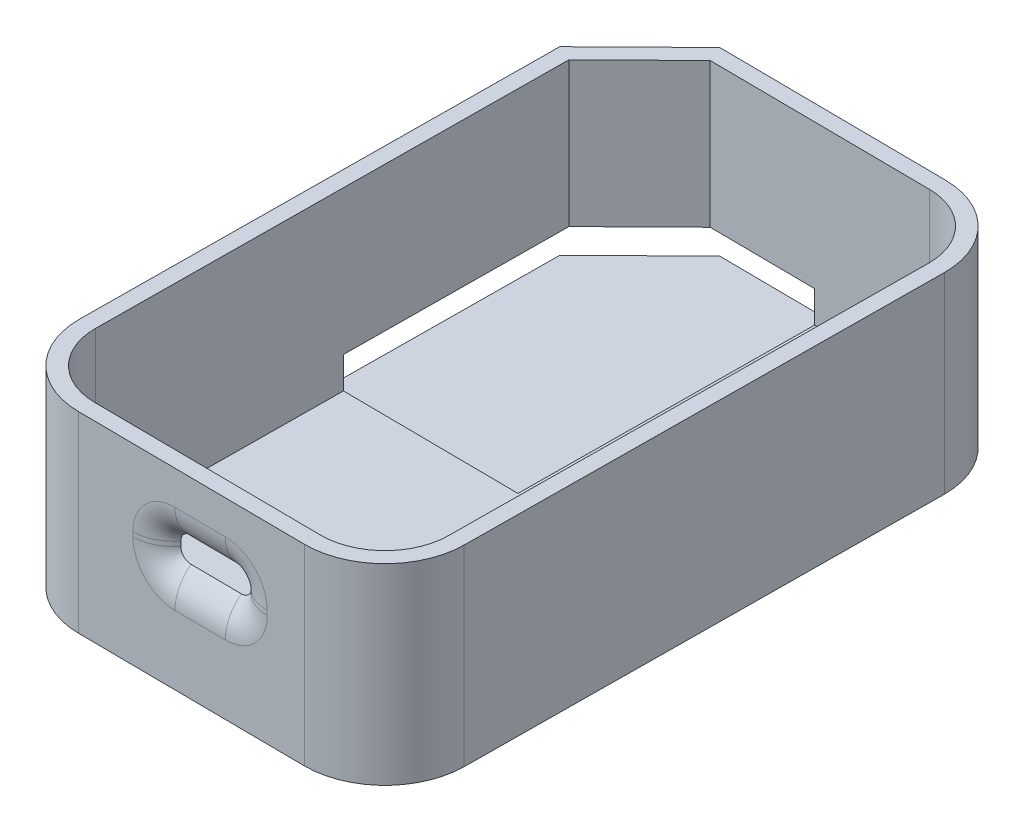
ISO-10303-21;
HEADER;
FILE_DESCRIPTION(('STEP AP214'),'2;1');
FILE_NAME('part.step','',(''),(''),'','','');
FILE_SCHEMA(('AUTOMOTIVE_DESIGN { 1 0 10303 214 1 1 1 1 }'));
ENDSEC;
DATA;
#1=APPLICATION_CONTEXT('core data for automotive mechanical design processes');
#2=APPLICATION_PROTOCOL_DEFINITION('international standard','automotive_design',2000,#1);
#3=PRODUCT_CONTEXT('',#1,'mechanical');
#4=PRODUCT('Part','Part','',(#3));
#5=PRODUCT_RELATED_PRODUCT_CATEGORY('part','',(#4));
#6=PRODUCT_DEFINITION_FORMATION('','',#4);
#7=PRODUCT_DEFINITION_CONTEXT('part definition',#1,'design');
#8=PRODUCT_DEFINITION('design','',#6,#7);
#9=PRODUCT_DEFINITION_SHAPE('','',#8);
#10=(LENGTH_UNIT() NAMED_UNIT(*) SI_UNIT(.MILLI.,.METRE.));
#11=(NAMED_UNIT(*) PLANE_ANGLE_UNIT() SI_UNIT($,.RADIAN.));
#12=(NAMED_UNIT(*) SI_UNIT($,.STERADIAN.) SOLID_ANGLE_UNIT());
#13=UNCERTAINTY_MEASURE_WITH_UNIT(LENGTH_MEASURE(1.E-05),#10,'distance_accuracy_value','');
#14=(GEOMETRIC_REPRESENTATION_CONTEXT(3) GLOBAL_UNCERTAINTY_ASSIGNED_CONTEXT((#13)) GLOBAL_UNIT_ASSIGNED_CONTEXT((#10,
#11,#12)) REPRESENTATION_CONTEXT('',''));
#15=CARTESIAN_POINT('',(0.,0.,0.));
#16=DIRECTION('',(0.,0.,1.));
#17=DIRECTION('',(1.,0.,0.));
#18=AXIS2_PLACEMENT_3D('',#15,#16,#17);
#19=CARTESIAN_POINT('',(-25.6124297825195,22.,-67.102484938882));
#20=DIRECTION('',(0.700909264300127,0.,0.713250449153911));
#21=DIRECTION('',(0.713250449153911,0.,-0.700909264300127));
#22=AXIS2_PLACEMENT_3D('',#19,#20,#21);
#23=PLANE('',#22);
#24=DIRECTION('',(0.,-1.,0.));
#25=VECTOR('',#24,1.);
#26=CARTESIAN_POINT('',(-35.6993143681448,22.,-57.1901310632165));
#27=LINE('',#26,#25);
#28=CARTESIAN_POINT('',(-35.6993143681448,-0.586956373766086,-57.1901310632165));
#29=VERTEX_POINT('',#28);
#30=CARTESIAN_POINT('',(-35.6993143681448,-2.,-57.1901310632165));
#31=VERTEX_POINT('',#30);
#32=EDGE_CURVE('E477',#29,#31,#27,.T.);
#33=ORIENTED_EDGE('',*,*,#32,.F.);
#34=DIRECTION('',(0.713250449153911,0.,-0.700909264300127));
#35=VECTOR('',#34,1.);
#36=CARTESIAN_POINT('',(-25.6124297825195,-0.586956373766087,-67.102484938882));
#37=LINE('',#36,#35);
#38=CARTESIAN_POINT('',(-25.6124297825195,-0.586956373766087,-67.102484938882));
#39=VERTEX_POINT('',#38);
#40=EDGE_CURVE('E337',#29,#39,#37,.T.);
#41=ORIENTED_EDGE('',*,*,#40,.T.);
#42=DIRECTION('',(0.,-1.,0.));
#43=VECTOR('',#42,1.);
#44=CARTESIAN_POINT('',(-25.6124297825195,22.,-67.102484938882));
#45=LINE('',#44,#43);
#46=CARTESIAN_POINT('',(-25.6124297825195,-2.,-67.102484938882));
#47=VERTEX_POINT('',#46);
#48=EDGE_CURVE('E473',#39,#47,#45,.T.);
#49=ORIENTED_EDGE('',*,*,#48,.T.);
#50=DIRECTION('',(0.713250449153911,0.,-0.700909264300127));
#51=VECTOR('',#50,1.);
#52=CARTESIAN_POINT('',(-46.1288480767684,-2.,-46.9410568321713));
#53=LINE('',#52,#51);
#54=EDGE_CURVE('E380',#31,#47,#53,.T.);
#55=ORIENTED_EDGE('',*,*,#54,.F.);
#56=EDGE_LOOP('',(#33,#41,#49,#55));
#57=FACE_BOUND('',#56,.T.);
#58=ADVANCED_FACE('F89',(#57),#23,.F.);
#59=CARTESIAN_POINT('',(2.79921966982612,22.,-56.8541594465581));
#60=DIRECTION('',(0.,-1.,0.));
#61=DIRECTION('',(0.,0.,-1.));
#62=AXIS2_PLACEMENT_3D('',#59,#60,#61);
#63=CYLINDRICAL_SURFACE('',#62,10.);
#64=DIRECTION('',(0.,-1.,0.));
#65=VECTOR('',#64,1.);
#66=CARTESIAN_POINT('',(12.7988389004678,22.,-56.7668940915745));
#67=LINE('',#66,#65);
#68=CARTESIAN_POINT('',(12.7988389004678,22.,-56.7668940915745));
#69=VERTEX_POINT('',#68);
#70=CARTESIAN_POINT('',(12.7988389004678,-2.,-56.7668940915745));
#71=VERTEX_POINT('',#70);
#72=EDGE_CURVE('E467',#69,#71,#67,.T.);
#73=ORIENTED_EDGE('',*,*,#72,.T.);
#74=CARTESIAN_POINT('',(2.79921966982612,-2.,-56.8541594465581));
#75=DIRECTION('',(0.,-1.,0.));
#76=DIRECTION('',(0.,0.,-1.));
#77=AXIS2_PLACEMENT_3D('',#74,#75,#76);
#78=CIRCLE('',#77,10.);
#79=CARTESIAN_POINT('',(2.88648502480233,-2.,-66.8537786771998));
#80=VERTEX_POINT('',#79);
#81=EDGE_CURVE('E362',#80,#71,#78,.T.);
#82=ORIENTED_EDGE('',*,*,#81,.F.);
#83=DIRECTION('',(0.,-1.,0.));
#84=VECTOR('',#83,1.);
#85=CARTESIAN_POINT('',(2.88648502480233,22.,-66.8537786771998));
#86=LINE('',#85,#84);
#87=CARTESIAN_POINT('',(2.88648502480233,22.,-66.8537786771998));
#88=VERTEX_POINT('',#87);
#89=EDGE_CURVE('E468',#88,#80,#86,.T.);
#90=ORIENTED_EDGE('',*,*,#89,.F.);
#91=CARTESIAN_POINT('',(2.79921966982612,22.,-56.8541594465581));
#92=DIRECTION('',(0.,-1.,0.));
#93=DIRECTION('',(0.,0.,-1.));
#94=AXIS2_PLACEMENT_3D('',#91,#92,#93);
#95=CIRCLE('',#94,10.);
#96=EDGE_CURVE('E426',#88,#69,#95,.T.);
#97=ORIENTED_EDGE('',*,*,#96,.T.);
#98=EDGE_LOOP('',(#73,#82,#90,#97));
#99=FACE_BOUND('',#98,.T.);
#100=ADVANCED_FACE('F556',(#99),#63,.T.);
#101=CARTESIAN_POINT('',(-25.6124297825195,22.,-67.102484938882));
#102=DIRECTION('',(0.00872653549762053,0.,-0.999961923064178));
#103=DIRECTION('',(-0.999961923064178,0.,-0.00872653549762053));
#104=AXIS2_PLACEMENT_3D('',#101,#102,#103);
#105=PLANE('',#104);
#106=DIRECTION('',(-0.999961923064172,0.,-0.00872653549835296));
#107=VECTOR('',#106,1.);
#108=CARTESIAN_POINT('',(-11.6129628596211,-0.586956373766087,-66.980313441905));
#109=LINE('',#108,#107);
#110=CARTESIAN_POINT('',(-11.6129628596211,-0.586956373766087,-66.980313441905));
#111=VERTEX_POINT('',#110);
#112=EDGE_CURVE('E311',#111,#39,#109,.T.);
#113=ORIENTED_EDGE('',*,*,#112,.F.);
#114=DIRECTION('',(0.,-1.,0.));
#115=VECTOR('',#114,1.);
#116=CARTESIAN_POINT('',(-11.6129628596211,3.94324801505611,-66.980313441905));
#117=LINE('',#116,#115);
#118=CARTESIAN_POINT('',(-11.6129628596211,3.94324801505611,-66.980313441905));
#119=VERTEX_POINT('',#118);
#120=EDGE_CURVE('E297',#119,#111,#117,.T.);
#121=ORIENTED_EDGE('',*,*,#120,.F.);
#122=DIRECTION('',(-0.999961923064172,0.,-0.00872653549835296));
#123=VECTOR('',#122,1.);
#124=CARTESIAN_POINT('',(-11.6129628596211,3.94324801505611,-66.980313441905));
#125=LINE('',#124,#123);
#126=CARTESIAN_POINT('',(-25.6124297825195,3.94324801505611,-67.102484938882));
#127=VERTEX_POINT('',#126);
#128=EDGE_CURVE('E305',#119,#127,#125,.T.);
#129=ORIENTED_EDGE('',*,*,#128,.T.);
#130=CARTESIAN_POINT('',(-25.6124297825195,22.,-67.102484938882));
#131=VERTEX_POINT('',#130);
#132=EDGE_CURVE('E471',#131,#127,#45,.T.);
#133=ORIENTED_EDGE('',*,*,#132,.F.);
#134=DIRECTION('',(0.999961923064178,0.,0.00872653549762053));
#135=VECTOR('',#134,1.);
#136=CARTESIAN_POINT('',(-25.6124297825195,22.,-67.102484938882));
#137=LINE('',#136,#135);
#138=EDGE_CURVE('E464',#131,#88,#137,.T.);
#139=ORIENTED_EDGE('',*,*,#138,.T.);
#140=ORIENTED_EDGE('',*,*,#89,.T.);
#141=DIRECTION('',(0.999961923064178,0.,0.00872653549762053));
#142=VECTOR('',#141,1.);
#143=CARTESIAN_POINT('',(0.583599471446085,-2.,-66.8738756549595));
#144=LINE('',#143,#142);
#145=EDGE_CURVE('E347',#47,#80,#144,.T.);
#146=ORIENTED_EDGE('',*,*,#145,.F.);
#147=ORIENTED_EDGE('',*,*,#48,.F.);
#148=EDGE_LOOP('',(#113,#121,#129,#133,#139,#140,#146,#147));
#149=FACE_BOUND('',#148,.T.);
#150=ADVANCED_FACE('F315',(#149),#105,.T.);
#151=ORIENTED_EDGE('',*,*,#132,.T.);
#152=DIRECTION('',(-0.713250449153911,0.,0.700909264300127));
#153=VECTOR('',#152,1.);
#154=CARTESIAN_POINT('',(-25.6124297825195,3.94324801505611,-67.102484938882));
#155=LINE('',#154,#153);
#156=CARTESIAN_POINT('',(-35.6993143681448,3.94324801505611,-57.1901310632165));
#157=VERTEX_POINT('',#156);
#158=EDGE_CURVE('E308',#127,#157,#155,.T.);
#159=ORIENTED_EDGE('',*,*,#158,.T.);
#160=CARTESIAN_POINT('',(-35.6993143681448,22.,-57.1901310632165));
#161=VERTEX_POINT('',#160);
#162=EDGE_CURVE('E474',#161,#157,#27,.T.);
#163=ORIENTED_EDGE('',*,*,#162,.F.);
#164=DIRECTION('',(-0.713250449153911,0.,0.700909264300127));
#165=VECTOR('',#164,1.);
#166=CARTESIAN_POINT('',(-25.6124297825195,22.,-67.102484938882));
#167=LINE('',#166,#165);
#168=EDGE_CURVE('E462',#131,#161,#167,.T.);
#169=ORIENTED_EDGE('',*,*,#168,.F.);
#170=EDGE_LOOP('',(#151,#159,#163,#169));
#171=FACE_BOUND('',#170,.T.);
#172=ADVANCED_FACE('F581',(#171),#23,.F.);
#173=CARTESIAN_POINT('',(-35.6993143681448,22.,-57.1901310632165));
#174=DIRECTION('',(0.999961923064172,0.,0.00872653549835296));
#175=DIRECTION('',(0.00872653549835296,0.,-0.999961923064172));
#176=AXIS2_PLACEMENT_3D('',#173,#174,#175);
#177=PLANE('',#176);
#178=DIRECTION('',(0.,1.,0.));
#179=VECTOR('',#178,1.);
#180=CARTESIAN_POINT('',(-35.9503940231901,3.94324801505612,-28.4192523165744));
#181=LINE('',#180,#179);
#182=CARTESIAN_POINT('',(-35.9503940231901,-0.586956373766083,-28.4192523165744));
#183=VERTEX_POINT('',#182);
#184=CARTESIAN_POINT('',(-35.9503940231901,3.94324801505612,-28.4192523165707));
#185=VERTEX_POINT('',#184);
#186=EDGE_CURVE('E104',#183,#185,#181,.T.);
#187=ORIENTED_EDGE('',*,*,#186,.F.);
#188=DIRECTION('',(0.00872653549835296,0.,-0.999961923064172));
#189=VECTOR('',#188,1.);
#190=CARTESIAN_POINT('',(-35.6993143681448,-0.586956373766087,-57.1901310632165));
#191=LINE('',#190,#189);
#192=EDGE_CURVE('E12',#183,#29,#191,.T.);
#193=ORIENTED_EDGE('',*,*,#192,.T.);
#194=ORIENTED_EDGE('',*,*,#32,.T.);
#195=DIRECTION('',(0.00872653549835296,0.,-0.999961923064172));
#196=VECTOR('',#195,1.);
#197=CARTESIAN_POINT('',(-36.1956484846561,-2.,-0.315874638925613));
#198=LINE('',#197,#196);
#199=CARTESIAN_POINT('',(-36.2185432302965,-2.,2.30760335907133));
#200=VERTEX_POINT('',#199);
#201=EDGE_CURVE('E377',#200,#31,#198,.T.);
#202=ORIENTED_EDGE('',*,*,#201,.F.);
#203=DIRECTION('',(0.,-1.,0.));
#204=VECTOR('',#203,1.);
#205=CARTESIAN_POINT('',(-36.2185432302965,22.,2.30760335907132));
#206=LINE('',#205,#204);
#207=CARTESIAN_POINT('',(-36.2185432302965,22.,2.30760335907132));
#208=VERTEX_POINT('',#207);
#209=EDGE_CURVE('E478',#208,#200,#206,.T.);
#210=ORIENTED_EDGE('',*,*,#209,.F.);
#211=DIRECTION('',(-0.00872653549835296,0.,0.999961923064172));
#212=VECTOR('',#211,1.);
#213=CARTESIAN_POINT('',(-35.6993143681448,22.,-57.1901310632165));
#214=LINE('',#213,#212);
#215=EDGE_CURVE('E460',#161,#208,#214,.T.);
#216=ORIENTED_EDGE('',*,*,#215,.F.);
#217=ORIENTED_EDGE('',*,*,#162,.T.);
#218=DIRECTION('',(0.00872653549835306,0.,-0.999961923064171));
#219=VECTOR('',#218,1.);
#220=CARTESIAN_POINT('',(-35.9503940231901,3.94324801505612,-28.4192523165744));
#221=LINE('',#220,#219);
#222=EDGE_CURVE('E323',#185,#157,#221,.T.);
#223=ORIENTED_EDGE('',*,*,#222,.F.);
#224=EDGE_LOOP('',(#187,#193,#194,#202,#210,#216,#217,#223));
#225=FACE_BOUND('',#224,.T.);
#226=ADVANCED_FACE('F545',(#225),#177,.F.);
#227=CARTESIAN_POINT('',(-26.2189239996548,22.,2.39486871405484));
#228=DIRECTION('',(0.,-1.,0.));
#229=DIRECTION('',(0.,0.,-1.));
#230=AXIS2_PLACEMENT_3D('',#227,#228,#229);
#231=CYLINDRICAL_SURFACE('',#230,9.99999999999999);
#232=ORIENTED_EDGE('',*,*,#209,.T.);
#233=CARTESIAN_POINT('',(-26.2189239996548,-2.,2.39486871405484));
#234=DIRECTION('',(0.,-1.,0.));
#235=DIRECTION('',(0.,0.,-1.));
#236=AXIS2_PLACEMENT_3D('',#233,#234,#235);
#237=CIRCLE('',#236,9.99999999999999);
#238=CARTESIAN_POINT('',(-26.3061893546383,-2.,12.3944879446966));
#239=VERTEX_POINT('',#238);
#240=EDGE_CURVE('E374',#239,#200,#237,.T.);
#241=ORIENTED_EDGE('',*,*,#240,.F.);
#242=DIRECTION('',(0.,-1.,0.));
#243=VECTOR('',#242,1.);
#244=CARTESIAN_POINT('',(-26.3061893546383,22.,12.3944879446966));
#245=LINE('',#244,#243);
#246=CARTESIAN_POINT('',(-26.3061893546383,22.,12.3944879446966));
#247=VERTEX_POINT('',#246);
#248=EDGE_CURVE('E480',#247,#239,#245,.T.);
#249=ORIENTED_EDGE('',*,*,#248,.F.);
#250=CARTESIAN_POINT('',(-26.2189239996548,22.,2.39486871405484));
#251=DIRECTION('',(0.,-1.,0.));
#252=DIRECTION('',(0.,0.,-1.));
#253=AXIS2_PLACEMENT_3D('',#250,#251,#252);
#254=CIRCLE('',#253,9.99999999999999);
#255=EDGE_CURVE('E457',#247,#208,#254,.T.);
#256=ORIENTED_EDGE('',*,*,#255,.T.);
#257=EDGE_LOOP('',(#232,#241,#249,#256));
#258=FACE_BOUND('',#257,.T.);
#259=ADVANCED_FACE('F575',(#258),#231,.T.);
#260=CARTESIAN_POINT('',(-26.3061893546383,22.,12.3944879446966));
#261=DIRECTION('',(0.00872653549834512,0.,-0.999961923064172));
#262=DIRECTION('',(-0.999961923064172,0.,-0.00872653549834512));
#263=AXIS2_PLACEMENT_3D('',#260,#261,#262);
#264=PLANE('',#263);
#265=DIRECTION('',(0.999961923064172,0.,0.00872653549834512));
#266=VECTOR('',#265,1.);
#267=CARTESIAN_POINT('',(-26.3061893546377,6.60548389285194,12.3944879446966));
#268=LINE('',#267,#266);
#269=CARTESIAN_POINT('',(-7.77229509541314,6.60548389285248,12.5562307895442));
#270=VERTEX_POINT('',#269);
#271=CARTESIAN_POINT('',(-14.121253337332,6.60548389285236,12.5008242703581));
#272=VERTEX_POINT('',#271);
#273=EDGE_CURVE('E498',#270,#272,#268,.F.);
#274=ORIENTED_EDGE('',*,*,#273,.T.);
#275=CARTESIAN_POINT('',(-14.1212533373322,11.9008838928524,12.5008242703581));
#276=DIRECTION('',(0.00872653549834512,0.,-0.999961923064172));
#277=DIRECTION('',(-0.999961923064172,0.,-0.00872653549834512));
#278=AXIS2_PLACEMENT_3D('',#275,#276,#277);
#279=CIRCLE('',#278,5.2954);
#280=CARTESIAN_POINT('',(-19.4164517047262,11.9008838928524,12.4546137742802));
#281=VERTEX_POINT('',#280);
#282=EDGE_CURVE('E500',#272,#281,#279,.T.);
#283=ORIENTED_EDGE('',*,*,#282,.T.);
#284=DIRECTION('',(0.,-1.,0.));
#285=VECTOR('',#284,1.);
#286=CARTESIAN_POINT('',(-19.4164517047262,22.,12.4546137742802));
#287=LINE('',#286,#285);
#288=CARTESIAN_POINT('',(-19.4164517047262,12.4700838928524,12.4546137742802));
#289=VERTEX_POINT('',#288);
#290=EDGE_CURVE('E470',#281,#289,#287,.F.);
#291=ORIENTED_EDGE('',*,*,#290,.T.);
#292=CARTESIAN_POINT('',(-14.1212533373322,12.4700838928524,12.5008242703581));
#293=DIRECTION('',(0.00872653549834512,0.,-0.999961923064172));
#294=DIRECTION('',(-0.999961923064172,0.,-0.00872653549834512));
#295=AXIS2_PLACEMENT_3D('',#292,#293,#294);
#296=CIRCLE('',#295,5.29539999999999);
#297=CARTESIAN_POINT('',(-14.1212533373323,17.7654838928524,12.5008242703581));
#298=VERTEX_POINT('',#297);
#299=EDGE_CURVE('E488',#289,#298,#296,.T.);
#300=ORIENTED_EDGE('',*,*,#299,.T.);
#301=DIRECTION('',(-0.999961923064172,0.,-0.00872653549834512));
#302=VECTOR('',#301,1.);
#303=CARTESIAN_POINT('',(-26.3061893546382,17.7654838928523,12.3944879446966));
#304=LINE('',#303,#302);
#305=CARTESIAN_POINT('',(-7.7722950954132,17.7654838928525,12.5562307895442));
#306=VERTEX_POINT('',#305);
#307=EDGE_CURVE('E490',#298,#306,#304,.F.);
#308=ORIENTED_EDGE('',*,*,#307,.T.);
#309=CARTESIAN_POINT('',(-7.77229509541314,12.4700838928525,12.5562307895442));
#310=DIRECTION('',(0.00872653549834512,0.,-0.999961923064172));
#311=DIRECTION('',(-0.999961923064172,0.,-0.00872653549834512));
#312=AXIS2_PLACEMENT_3D('',#309,#310,#311);
#313=CIRCLE('',#312,5.2954);
#314=CARTESIAN_POINT('',(-2.47709672801913,12.4700838928525,12.6024412856221));
#315=VERTEX_POINT('',#314);
#316=EDGE_CURVE('E492',#306,#315,#313,.T.);
#317=ORIENTED_EDGE('',*,*,#316,.T.);
#318=DIRECTION('',(0.,1.,0.));
#319=VECTOR('',#318,1.);
#320=CARTESIAN_POINT('',(-2.47709672801904,21.9999999999998,12.6024412856221));
#321=LINE('',#320,#319);
#322=CARTESIAN_POINT('',(-2.47709672801913,11.9008838928524,12.6024412856221));
#323=VERTEX_POINT('',#322);
#324=EDGE_CURVE('E494',#315,#323,#321,.F.);
#325=ORIENTED_EDGE('',*,*,#324,.T.);
#326=CARTESIAN_POINT('',(-7.77229509541314,11.9008838928525,12.5562307895442));
#327=DIRECTION('',(0.00872653549834512,0.,-0.999961923064172));
#328=DIRECTION('',(-0.999961923064172,0.,-0.00872653549834512));
#329=AXIS2_PLACEMENT_3D('',#326,#327,#328);
#330=CIRCLE('',#329,5.29539999999999);
#331=EDGE_CURVE('E496',#323,#270,#330,.T.);
#332=ORIENTED_EDGE('',*,*,#331,.T.);
#333=EDGE_LOOP('',(#274,#283,#291,#300,#308,#317,#325,#332));
#334=FACE_BOUND('',#333,.T.);
#335=ORIENTED_EDGE('',*,*,#248,.T.);
#336=DIRECTION('',(-0.999961923064172,0.,-0.00872653549834512));
#337=VECTOR('',#336,1.);
#338=CARTESIAN_POINT('',(-0.110160100623857,-2.,12.6230972286384));
#339=LINE('',#338,#337);
#340=CARTESIAN_POINT('',(2.19272545269066,-2.,12.6431942063994));
#341=VERTEX_POINT('',#340);
#342=EDGE_CURVE('E371',#341,#239,#339,.T.);
#343=ORIENTED_EDGE('',*,*,#342,.F.);
#344=DIRECTION('',(0.,-1.,0.));
#345=VECTOR('',#344,1.);
#346=CARTESIAN_POINT('',(2.19272545269065,22.,12.6431942063994));
#347=LINE('',#346,#345);
#348=CARTESIAN_POINT('',(2.19272545269065,22.,12.6431942063994));
#349=VERTEX_POINT('',#348);
#350=EDGE_CURVE('E482',#349,#341,#347,.T.);
#351=ORIENTED_EDGE('',*,*,#350,.F.);
#352=DIRECTION('',(0.999961923064172,0.,0.00872653549834512));
#353=VECTOR('',#352,1.);
#354=CARTESIAN_POINT('',(-26.3061893546383,22.,12.3944879446966));
#355=LINE('',#354,#353);
#356=EDGE_CURVE('E455',#247,#349,#355,.T.);
#357=ORIENTED_EDGE('',*,*,#356,.F.);
#358=EDGE_LOOP('',(#335,#343,#351,#357));
#359=FACE_BOUND('',#358,.T.);
#360=ADVANCED_FACE('F572',(#334,#359),#264,.F.);
#361=CARTESIAN_POINT('',(2.2799908076741,22.,2.64357497575768));
#362=DIRECTION('',(0.,-1.,0.));
#363=DIRECTION('',(0.,0.,-1.));
#364=AXIS2_PLACEMENT_3D('',#361,#362,#363);
#365=CYLINDRICAL_SURFACE('',#364,10.);
#366=ORIENTED_EDGE('',*,*,#350,.T.);
#367=CARTESIAN_POINT('',(2.2799908076741,-2.,2.64357497575768));
#368=DIRECTION('',(0.,-1.,0.));
#369=DIRECTION('',(0.,0.,-1.));
#370=AXIS2_PLACEMENT_3D('',#367,#368,#369);
#371=CIRCLE('',#370,10.);
#372=CARTESIAN_POINT('',(12.2796100383158,-2.,2.73084033074121));
#373=VERTEX_POINT('',#372);
#374=EDGE_CURVE('E368',#373,#341,#371,.T.);
#375=ORIENTED_EDGE('',*,*,#374,.F.);
#376=DIRECTION('',(0.,-1.,0.));
#377=VECTOR('',#376,1.);
#378=CARTESIAN_POINT('',(12.2796100383158,22.,2.73084033074121));
#379=LINE('',#378,#377);
#380=CARTESIAN_POINT('',(12.2796100383158,22.,2.73084033074121));
#381=VERTEX_POINT('',#380);
#382=EDGE_CURVE('E484',#381,#373,#379,.T.);
#383=ORIENTED_EDGE('',*,*,#382,.F.);
#384=CARTESIAN_POINT('',(2.2799908076741,22.,2.64357497575768));
#385=DIRECTION('',(0.,-1.,0.));
#386=DIRECTION('',(0.,0.,-1.));
#387=AXIS2_PLACEMENT_3D('',#384,#385,#386);
#388=CIRCLE('',#387,10.);
#389=EDGE_CURVE('E452',#381,#349,#388,.T.);
#390=ORIENTED_EDGE('',*,*,#389,.T.);
#391=EDGE_LOOP('',(#366,#375,#383,#390));
#392=FACE_BOUND('',#391,.T.);
#393=ADVANCED_FACE('F564',(#392),#365,.T.);
#394=CARTESIAN_POINT('',(12.7988389004678,22.,-56.7668940915745));
#395=DIRECTION('',(0.999961923064172,0.,0.00872653549835387));
#396=DIRECTION('',(0.00872653549835387,0.,-0.999961923064172));
#397=AXIS2_PLACEMENT_3D('',#394,#395,#396);
#398=PLANE('',#397);
#399=ORIENTED_EDGE('',*,*,#382,.T.);
#400=DIRECTION('',(-0.00872653549835387,0.,0.999961923064172));
#401=VECTOR('',#400,1.);
#402=CARTESIAN_POINT('',(12.3025047839562,-2.,0.107362332744517));
#403=LINE('',#402,#401);
#404=EDGE_CURVE('E365',#71,#373,#403,.T.);
#405=ORIENTED_EDGE('',*,*,#404,.F.);
#406=ORIENTED_EDGE('',*,*,#72,.F.);
#407=DIRECTION('',(-0.00872653549835387,0.,0.999961923064171));
#408=VECTOR('',#407,1.);
#409=CARTESIAN_POINT('',(12.7988389004678,22.,-56.7668940915745));
#410=LINE('',#409,#408);
#411=EDGE_CURVE('E449',#69,#381,#410,.T.);
#412=ORIENTED_EDGE('',*,*,#411,.T.);
#413=EDGE_LOOP('',(#399,#405,#406,#412));
#414=FACE_BOUND('',#413,.T.);
#415=ADVANCED_FACE('F560',(#414),#398,.T.);
#416=CARTESIAN_POINT('',(2.79921966982612,22.,-56.8541594465581));
#417=DIRECTION('',(0.,-1.,0.));
#418=DIRECTION('',(0.,0.,-1.));
#419=AXIS2_PLACEMENT_3D('',#416,#417,#418);
#420=PLANE('',#419);
#421=DIRECTION('',(0.999961923064178,0.,0.00872653549762053));
#422=VECTOR('',#421,1.);
#423=CARTESIAN_POINT('',(2.86903195380709,22.,-64.8538548310715));
#424=LINE('',#423,#422);
#425=CARTESIAN_POINT('',(-24.8014872727354,22.,-65.0953317940423));
#426=VERTEX_POINT('',#425);
#427=CARTESIAN_POINT('',(2.8690319538071,22.,-64.8538548310715));
#428=VERTEX_POINT('',#427);
#429=EDGE_CURVE('E403',#426,#428,#424,.T.);
#430=ORIENTED_EDGE('',*,*,#429,.T.);
#431=CARTESIAN_POINT('',(2.79921966982612,22.,-56.8541594465581));
#432=DIRECTION('',(0.,-1.,0.));
#433=DIRECTION('',(-1.,0.,0.));
#434=AXIS2_PLACEMENT_3D('',#431,#432,#433);
#435=CIRCLE('',#434,8.);
#436=CARTESIAN_POINT('',(10.7989150543395,22.,-56.7843471625712));
#437=VERTEX_POINT('',#436);
#438=EDGE_CURVE('E384',#428,#437,#435,.T.);
#439=ORIENTED_EDGE('',*,*,#438,.T.);
#440=DIRECTION('',(-0.00872653549835387,0.,0.999961923064172));
#441=VECTOR('',#440,1.);
#442=CARTESIAN_POINT('',(10.7989150543395,22.,-56.7843471625712));
#443=LINE('',#442,#441);
#444=CARTESIAN_POINT('',(10.2796861921875,22.,2.71338725974452));
#445=VERTEX_POINT('',#444);
#446=EDGE_CURVE('E387',#437,#445,#443,.T.);
#447=ORIENTED_EDGE('',*,*,#446,.T.);
#448=CARTESIAN_POINT('',(2.2799908076741,22.,2.64357497575768));
#449=DIRECTION('',(0.,-1.,0.));
#450=DIRECTION('',(-1.,0.,0.));
#451=AXIS2_PLACEMENT_3D('',#448,#449,#450);
#452=CIRCLE('',#451,8.);
#453=CARTESIAN_POINT('',(2.21017852368734,22.,10.643270360271));
#454=VERTEX_POINT('',#453);
#455=EDGE_CURVE('E391',#445,#454,#452,.T.);
#456=ORIENTED_EDGE('',*,*,#455,.T.);
#457=DIRECTION('',(0.999961923064172,0.,0.00872653549834512));
#458=VECTOR('',#457,1.);
#459=CARTESIAN_POINT('',(2.21017852368785,22.,10.6432703602711));
#460=LINE('',#459,#458);
#461=CARTESIAN_POINT('',(-26.2887362836416,22.,10.3945640985682));
#462=VERTEX_POINT('',#461);
#463=EDGE_CURVE('E394',#462,#454,#460,.T.);
#464=ORIENTED_EDGE('',*,*,#463,.F.);
#465=CARTESIAN_POINT('',(-26.2189239996548,22.,2.39486871405484));
#466=DIRECTION('',(0.,-1.,0.));
#467=DIRECTION('',(-1.,0.,0.));
#468=AXIS2_PLACEMENT_3D('',#465,#466,#467);
#469=CIRCLE('',#468,7.99999999999999);
#470=CARTESIAN_POINT('',(-34.2186193841682,22.,2.32505643006802));
#471=VERTEX_POINT('',#470);
#472=EDGE_CURVE('E396',#462,#471,#469,.T.);
#473=ORIENTED_EDGE('',*,*,#472,.T.);
#474=DIRECTION('',(-0.00872653549835296,0.,0.999961923064172));
#475=VECTOR('',#474,1.);
#476=CARTESIAN_POINT('',(-33.6993905220162,22.,-57.172677992248));
#477=LINE('',#476,#475);
#478=CARTESIAN_POINT('',(-33.7066198207283,22.,-56.3442824114405));
#479=VERTEX_POINT('',#478);
#480=EDGE_CURVE('E399',#479,#471,#477,.T.);
#481=ORIENTED_EDGE('',*,*,#480,.F.);
#482=DIRECTION('',(-0.713250449153911,0.,0.700909264300127));
#483=VECTOR('',#482,1.);
#484=CARTESIAN_POINT('',(-14.8802430122158,22.,-74.8449113755648));
#485=LINE('',#484,#483);
#486=EDGE_CURVE('E401',#426,#479,#485,.T.);
#487=ORIENTED_EDGE('',*,*,#486,.F.);
#488=EDGE_LOOP('',(#430,#439,#447,#456,#464,#473,#481,#487));
#489=FACE_BOUND('',#488,.T.);
#490=ORIENTED_EDGE('',*,*,#96,.F.);
#491=ORIENTED_EDGE('',*,*,#138,.F.);
#492=ORIENTED_EDGE('',*,*,#168,.T.);
#493=ORIENTED_EDGE('',*,*,#215,.T.);
#494=ORIENTED_EDGE('',*,*,#255,.F.);
#495=ORIENTED_EDGE('',*,*,#356,.T.);
#496=ORIENTED_EDGE('',*,*,#389,.F.);
#497=ORIENTED_EDGE('',*,*,#411,.F.);
#498=EDGE_LOOP('',(#490,#491,#492,#493,#494,#495,#496,#497));
#499=FACE_BOUND('',#498,.T.);
#500=ADVANCED_FACE('F566',(#489,#499),#420,.F.);
#501=CARTESIAN_POINT('',(2.79921966982612,22.,-56.8541594465581));
#502=DIRECTION('',(0.,-1.,0.));
#503=DIRECTION('',(0.,0.,-1.));
#504=AXIS2_PLACEMENT_3D('',#501,#502,#503);
#505=CYLINDRICAL_SURFACE('',#504,8.);
#506=CARTESIAN_POINT('',(2.79921966982612,0.,-56.8541594465581));
#507=DIRECTION('',(0.,-1.,0.));
#508=DIRECTION('',(-1.,0.,0.));
#509=AXIS2_PLACEMENT_3D('',#506,#507,#508);
#510=CIRCLE('',#509,8.);
#511=CARTESIAN_POINT('',(2.8690319538071,0.,-64.8538548310715));
#512=VERTEX_POINT('',#511);
#513=CARTESIAN_POINT('',(10.7989150543395,0.,-56.7843471625712));
#514=VERTEX_POINT('',#513);
#515=EDGE_CURVE('E383',#512,#514,#510,.T.);
#516=ORIENTED_EDGE('',*,*,#515,.T.);
#517=DIRECTION('',(0.,-1.,0.));
#518=VECTOR('',#517,1.);
#519=CARTESIAN_POINT('',(10.7989150543395,22.,-56.7843471625712));
#520=LINE('',#519,#518);
#521=EDGE_CURVE('E406',#437,#514,#520,.T.);
#522=ORIENTED_EDGE('',*,*,#521,.F.);
#523=ORIENTED_EDGE('',*,*,#438,.F.);
#524=DIRECTION('',(0.,-1.,0.));
#525=VECTOR('',#524,1.);
#526=CARTESIAN_POINT('',(2.8690319538071,22.,-64.8538548310715));
#527=LINE('',#526,#525);
#528=EDGE_CURVE('E423',#428,#512,#527,.T.);
#529=ORIENTED_EDGE('',*,*,#528,.T.);
#530=EDGE_LOOP('',(#516,#522,#523,#529));
#531=FACE_BOUND('',#530,.T.);
#532=ADVANCED_FACE('F688',(#531),#505,.F.);
#533=CARTESIAN_POINT('',(2.86903195380709,22.,-64.8538548310715));
#534=DIRECTION('',(0.00872653549762053,0.,-0.999961923064178));
#535=DIRECTION('',(-0.999961923064178,0.,-0.00872653549762053));
#536=AXIS2_PLACEMENT_3D('',#533,#534,#535);
#537=PLANE('',#536);
#538=DIRECTION('',(0.,-1.,0.));
#539=VECTOR('',#538,1.);
#540=CARTESIAN_POINT('',(-24.8014872727354,22.,-65.0953317940423));
#541=LINE('',#540,#539);
#542=CARTESIAN_POINT('',(-24.8014872727354,3.94324801505611,-65.0953317940423));
#543=VERTEX_POINT('',#542);
#544=EDGE_CURVE('E427',#426,#543,#541,.T.);
#545=ORIENTED_EDGE('',*,*,#544,.T.);
#546=DIRECTION('',(0.999961923064178,0.,0.00872653549762053));
#547=VECTOR('',#546,1.);
#548=CARTESIAN_POINT('',(2.86903195380709,3.94324801505611,-64.8538548310715));
#549=LINE('',#548,#547);
#550=CARTESIAN_POINT('',(-11.6304159306177,3.94324801505611,-64.9803895957869));
#551=VERTEX_POINT('',#550);
#552=EDGE_CURVE('E334',#543,#551,#549,.T.);
#553=ORIENTED_EDGE('',*,*,#552,.T.);
#554=DIRECTION('',(0.,-1.,0.));
#555=VECTOR('',#554,1.);
#556=CARTESIAN_POINT('',(-11.6304159306177,22.,-64.9803895957869));
#557=LINE('',#556,#555);
#558=CARTESIAN_POINT('',(-11.6304159306177,0.,-64.9803895957869));
#559=VERTEX_POINT('',#558);
#560=EDGE_CURVE('E300',#551,#559,#557,.T.);
#561=ORIENTED_EDGE('',*,*,#560,.T.);
#562=DIRECTION('',(0.999961923064178,0.,0.00872653549762053));
#563=VECTOR('',#562,1.);
#564=CARTESIAN_POINT('',(2.86903195380709,0.,-64.8538548310715));
#565=LINE('',#564,#563);
#566=EDGE_CURVE('E388',#559,#512,#565,.T.);
#567=ORIENTED_EDGE('',*,*,#566,.T.);
#568=ORIENTED_EDGE('',*,*,#528,.F.);
#569=ORIENTED_EDGE('',*,*,#429,.F.);
#570=EDGE_LOOP('',(#545,#553,#561,#567,#568,#569));
#571=FACE_BOUND('',#570,.T.);
#572=ADVANCED_FACE('F682',(#571),#537,.F.);
#573=CARTESIAN_POINT('',(-14.8802430122158,22.,-74.8449113755648));
#574=DIRECTION('',(0.700909264300127,0.,0.713250449153911));
#575=DIRECTION('',(0.713250449153911,0.,-0.700909264300127));
#576=AXIS2_PLACEMENT_3D('',#573,#574,#575);
#577=PLANE('',#576);
#578=DIRECTION('',(-0.713250449153911,0.,0.700909264300127));
#579=VECTOR('',#578,1.);
#580=CARTESIAN_POINT('',(-14.8802430122158,3.94324801505611,-74.8449113755648));
#581=LINE('',#580,#579);
#582=CARTESIAN_POINT('',(-33.7066198207283,3.94324801505611,-56.3442824114405));
#583=VERTEX_POINT('',#582);
#584=EDGE_CURVE('E332',#543,#583,#581,.T.);
#585=ORIENTED_EDGE('',*,*,#584,.F.);
#586=ORIENTED_EDGE('',*,*,#544,.F.);
#587=ORIENTED_EDGE('',*,*,#486,.T.);
#588=DIRECTION('',(0.,-1.,0.));
#589=VECTOR('',#588,1.);
#590=CARTESIAN_POINT('',(-33.7066198207283,22.,-56.3442824114405));
#591=LINE('',#590,#589);
#592=EDGE_CURVE('E430',#479,#583,#591,.T.);
#593=ORIENTED_EDGE('',*,*,#592,.T.);
#594=EDGE_LOOP('',(#585,#586,#587,#593));
#595=FACE_BOUND('',#594,.T.);
#596=ADVANCED_FACE('F687',(#595),#577,.T.);
#597=CARTESIAN_POINT('',(-33.6993905220162,22.,-57.172677992248));
#598=DIRECTION('',(0.999961923064172,0.,0.00872653549835296));
#599=DIRECTION('',(0.00872653549835296,0.,-0.999961923064172));
#600=AXIS2_PLACEMENT_3D('',#597,#598,#599);
#601=PLANE('',#600);
#602=DIRECTION('',(0.,-1.,0.));
#603=VECTOR('',#602,1.);
#604=CARTESIAN_POINT('',(-33.9504701770617,22.,-28.4017992455777));
#605=LINE('',#604,#603);
#606=CARTESIAN_POINT('',(-33.9504701770617,3.94324801505612,-28.4017992455777));
#607=VERTEX_POINT('',#606);
#608=CARTESIAN_POINT('',(-33.9504701770618,0.,-28.4017992455777));
#609=VERTEX_POINT('',#608);
#610=EDGE_CURVE('E330',#607,#609,#605,.T.);
#611=ORIENTED_EDGE('',*,*,#610,.F.);
#612=DIRECTION('',(-0.00872653549835296,0.,0.999961923064172));
#613=VECTOR('',#612,1.);
#614=CARTESIAN_POINT('',(-33.6993905220162,3.94324801505611,-57.172677992248));
#615=LINE('',#614,#613);
#616=EDGE_CURVE('E97',#583,#607,#615,.T.);
#617=ORIENTED_EDGE('',*,*,#616,.F.);
#618=ORIENTED_EDGE('',*,*,#592,.F.);
#619=ORIENTED_EDGE('',*,*,#480,.T.);
#620=DIRECTION('',(0.,-1.,0.));
#621=VECTOR('',#620,1.);
#622=CARTESIAN_POINT('',(-34.2186193841682,22.,2.32505643006802));
#623=LINE('',#622,#621);
#624=CARTESIAN_POINT('',(-34.2186193841682,0.,2.32505643006802));
#625=VERTEX_POINT('',#624);
#626=EDGE_CURVE('E433',#471,#625,#623,.T.);
#627=ORIENTED_EDGE('',*,*,#626,.T.);
#628=DIRECTION('',(-0.00872653549835296,0.,0.999961923064172));
#629=VECTOR('',#628,1.);
#630=CARTESIAN_POINT('',(-33.6993905220162,0.,-57.172677992248));
#631=LINE('',#630,#629);
#632=EDGE_CURVE('E420',#609,#625,#631,.T.);
#633=ORIENTED_EDGE('',*,*,#632,.F.);
#634=EDGE_LOOP('',(#611,#617,#618,#619,#627,#633));
#635=FACE_BOUND('',#634,.T.);
#636=ADVANCED_FACE('F536',(#635),#601,.T.);
#637=CARTESIAN_POINT('',(-26.2189239996548,22.,2.39486871405484));
#638=DIRECTION('',(0.,-1.,0.));
#639=DIRECTION('',(0.,0.,-1.));
#640=AXIS2_PLACEMENT_3D('',#637,#638,#639);
#641=CYLINDRICAL_SURFACE('',#640,7.99999999999999);
#642=CARTESIAN_POINT('',(-26.2189239996548,0.,2.39486871405484));
#643=DIRECTION('',(0.,-1.,0.));
#644=DIRECTION('',(-1.,0.,0.));
#645=AXIS2_PLACEMENT_3D('',#642,#643,#644);
#646=CIRCLE('',#645,7.99999999999999);
#647=CARTESIAN_POINT('',(-26.2887362836416,0.,10.3945640985682));
#648=VERTEX_POINT('',#647);
#649=EDGE_CURVE('E417',#648,#625,#646,.T.);
#650=ORIENTED_EDGE('',*,*,#649,.T.);
#651=ORIENTED_EDGE('',*,*,#626,.F.);
#652=ORIENTED_EDGE('',*,*,#472,.F.);
#653=DIRECTION('',(0.,-1.,0.));
#654=VECTOR('',#653,1.);
#655=CARTESIAN_POINT('',(-26.2887362836416,22.,10.3945640985682));
#656=LINE('',#655,#654);
#657=EDGE_CURVE('E436',#462,#648,#656,.T.);
#658=ORIENTED_EDGE('',*,*,#657,.T.);
#659=EDGE_LOOP('',(#650,#651,#652,#658));
#660=FACE_BOUND('',#659,.T.);
#661=ADVANCED_FACE('F711',(#660),#641,.F.);
#662=CARTESIAN_POINT('',(2.21017852368785,22.,10.6432703602711));
#663=DIRECTION('',(0.00872653549834512,0.,-0.999961923064172));
#664=DIRECTION('',(-0.999961923064172,0.,-0.00872653549834512));
#665=AXIS2_PLACEMENT_3D('',#662,#663,#664);
#666=PLANE('',#665);
#667=CARTESIAN_POINT('',(-7.75484202441645,11.9008838928525,10.5563069434158));
#668=DIRECTION('',(0.00872653549834512,0.,-0.999961923064172));
#669=DIRECTION('',(-0.999961923064172,0.,-0.00872653549834512));
#670=AXIS2_PLACEMENT_3D('',#667,#668,#669);
#671=CIRCLE('',#670,1.29539999999999);
#672=CARTESIAN_POINT('',(-7.75484202441645,10.6054838928526,10.5563069434158));
#673=VERTEX_POINT('',#672);
#674=CARTESIAN_POINT('',(-6.45949134927912,11.9008838928525,10.5676112975004));
#675=VERTEX_POINT('',#674);
#676=EDGE_CURVE('E341',#673,#675,#671,.F.);
#677=ORIENTED_EDGE('',*,*,#676,.T.);
#678=DIRECTION('',(0.,1.,0.));
#679=VECTOR('',#678,1.);
#680=CARTESIAN_POINT('',(-6.45949134927912,11.9008838928525,10.5676112975004));
#681=LINE('',#680,#679);
#682=CARTESIAN_POINT('',(-6.45949134927912,12.4700838928525,10.5676112975004));
#683=VERTEX_POINT('',#682);
#684=EDGE_CURVE('E343',#675,#683,#681,.T.);
#685=ORIENTED_EDGE('',*,*,#684,.T.);
#686=CARTESIAN_POINT('',(-7.75484202441645,12.4700838928525,10.5563069434158));
#687=DIRECTION('',(0.00872653549834512,0.,-0.999961923064172));
#688=DIRECTION('',(-0.999961923064172,0.,-0.00872653549834512));
#689=AXIS2_PLACEMENT_3D('',#686,#687,#688);
#690=CIRCLE('',#689,1.2954);
#691=CARTESIAN_POINT('',(-7.75484202441648,13.7654838928525,10.5563069434158));
#692=VERTEX_POINT('',#691);
#693=EDGE_CURVE('E357',#683,#692,#690,.F.);
#694=ORIENTED_EDGE('',*,*,#693,.T.);
#695=DIRECTION('',(-0.999961923064172,0.,-0.00872653549834512));
#696=VECTOR('',#695,1.);
#697=CARTESIAN_POINT('',(-7.75484202441648,13.7654838928525,10.5563069434158));
#698=LINE('',#697,#696);
#699=CARTESIAN_POINT('',(-14.1038002663355,13.7654838928524,10.5009004242298));
#700=VERTEX_POINT('',#699);
#701=EDGE_CURVE('E355',#692,#700,#698,.T.);
#702=ORIENTED_EDGE('',*,*,#701,.T.);
#703=CARTESIAN_POINT('',(-14.1038002663355,12.4700838928524,10.5009004242298));
#704=DIRECTION('',(0.00872653549834512,0.,-0.999961923064172));
#705=DIRECTION('',(-0.999961923064172,0.,-0.00872653549834512));
#706=AXIS2_PLACEMENT_3D('',#703,#704,#705);
#707=CIRCLE('',#706,1.2954);
#708=CARTESIAN_POINT('',(-15.3991509414728,12.4700838928524,10.4895960701452));
#709=VERTEX_POINT('',#708);
#710=EDGE_CURVE('E353',#700,#709,#707,.F.);
#711=ORIENTED_EDGE('',*,*,#710,.T.);
#712=DIRECTION('',(0.,-1.,0.));
#713=VECTOR('',#712,1.);
#714=CARTESIAN_POINT('',(-15.3991509414728,12.4700838928524,10.4895960701452));
#715=LINE('',#714,#713);
#716=CARTESIAN_POINT('',(-15.3991509414728,11.9008838928524,10.4895960701452));
#717=VERTEX_POINT('',#716);
#718=EDGE_CURVE('E351',#709,#717,#715,.T.);
#719=ORIENTED_EDGE('',*,*,#718,.T.);
#720=CARTESIAN_POINT('',(-14.1038002663355,11.9008838928524,10.5009004242298));
#721=DIRECTION('',(0.00872653549834512,0.,-0.999961923064172));
#722=DIRECTION('',(-0.999961923064172,0.,-0.00872653549834512));
#723=AXIS2_PLACEMENT_3D('',#720,#721,#722);
#724=CIRCLE('',#723,1.2954);
#725=CARTESIAN_POINT('',(-14.1038002663355,10.6054838928524,10.5009004242298));
#726=VERTEX_POINT('',#725);
#727=EDGE_CURVE('E348',#717,#726,#724,.F.);
#728=ORIENTED_EDGE('',*,*,#727,.T.);
#729=DIRECTION('',(0.999961923064172,0.,0.00872653549834512));
#730=VECTOR('',#729,1.);
#731=CARTESIAN_POINT('',(-11.466800679023,10.6054838928524,10.5239131709924));
#732=LINE('',#731,#730);
#733=EDGE_CURVE('E345',#726,#673,#732,.T.);
#734=ORIENTED_EDGE('',*,*,#733,.T.);
#735=EDGE_LOOP('',(#677,#685,#694,#702,#711,#719,#728,#734));
#736=FACE_BOUND('',#735,.T.);
#737=DIRECTION('',(0.999961923064172,0.,0.00872653549834512));
#738=VECTOR('',#737,1.);
#739=CARTESIAN_POINT('',(2.21017852368785,0.,10.6432703602711));
#740=LINE('',#739,#738);
#741=CARTESIAN_POINT('',(2.21017852368734,0.,10.643270360271));
#742=VERTEX_POINT('',#741);
#743=EDGE_CURVE('E415',#648,#742,#740,.T.);
#744=ORIENTED_EDGE('',*,*,#743,.F.);
#745=ORIENTED_EDGE('',*,*,#657,.F.);
#746=ORIENTED_EDGE('',*,*,#463,.T.);
#747=DIRECTION('',(0.,-1.,0.));
#748=VECTOR('',#747,1.);
#749=CARTESIAN_POINT('',(2.21017852368734,22.,10.643270360271));
#750=LINE('',#749,#748);
#751=EDGE_CURVE('E439',#454,#742,#750,.T.);
#752=ORIENTED_EDGE('',*,*,#751,.T.);
#753=EDGE_LOOP('',(#744,#745,#746,#752));
#754=FACE_BOUND('',#753,.T.);
#755=ADVANCED_FACE('F639',(#736,#754),#666,.T.);
#756=CARTESIAN_POINT('',(2.2799908076741,22.,2.64357497575768));
#757=DIRECTION('',(0.,-1.,0.));
#758=DIRECTION('',(0.,0.,-1.));
#759=AXIS2_PLACEMENT_3D('',#756,#757,#758);
#760=CYLINDRICAL_SURFACE('',#759,8.);
#761=CARTESIAN_POINT('',(2.2799908076741,0.,2.64357497575768));
#762=DIRECTION('',(0.,-1.,0.));
#763=DIRECTION('',(-1.,0.,0.));
#764=AXIS2_PLACEMENT_3D('',#761,#762,#763);
#765=CIRCLE('',#764,8.);
#766=CARTESIAN_POINT('',(10.2796861921875,0.,2.71338725974452));
#767=VERTEX_POINT('',#766);
#768=EDGE_CURVE('E412',#767,#742,#765,.T.);
#769=ORIENTED_EDGE('',*,*,#768,.T.);
#770=ORIENTED_EDGE('',*,*,#751,.F.);
#771=ORIENTED_EDGE('',*,*,#455,.F.);
#772=DIRECTION('',(0.,-1.,0.));
#773=VECTOR('',#772,1.);
#774=CARTESIAN_POINT('',(10.2796861921875,22.,2.71338725974452));
#775=LINE('',#774,#773);
#776=EDGE_CURVE('E442',#445,#767,#775,.T.);
#777=ORIENTED_EDGE('',*,*,#776,.T.);
#778=EDGE_LOOP('',(#769,#770,#771,#777));
#779=FACE_BOUND('',#778,.T.);
#780=ADVANCED_FACE('F838',(#779),#760,.F.);
#781=CARTESIAN_POINT('',(10.7989150543395,22.,-56.7843471625712));
#782=DIRECTION('',(0.999961923064172,0.,0.00872653549835387));
#783=DIRECTION('',(0.00872653549835387,0.,-0.999961923064172));
#784=AXIS2_PLACEMENT_3D('',#781,#782,#783);
#785=PLANE('',#784);
#786=DIRECTION('',(-0.00872653549835387,0.,0.999961923064172));
#787=VECTOR('',#786,1.);
#788=CARTESIAN_POINT('',(10.7989150543395,0.,-56.7843471625712));
#789=LINE('',#788,#787);
#790=EDGE_CURVE('E409',#514,#767,#789,.T.);
#791=ORIENTED_EDGE('',*,*,#790,.T.);
#792=ORIENTED_EDGE('',*,*,#776,.F.);
#793=ORIENTED_EDGE('',*,*,#446,.F.);
#794=ORIENTED_EDGE('',*,*,#521,.T.);
#795=EDGE_LOOP('',(#791,#792,#793,#794));
#796=FACE_BOUND('',#795,.T.);
#797=ADVANCED_FACE('F723',(#796),#785,.F.);
#798=CARTESIAN_POINT('',(0.,0.,0.));
#799=DIRECTION('',(0.,-1.,0.));
#800=DIRECTION('',(0.,0.,-1.));
#801=AXIS2_PLACEMENT_3D('',#798,#799,#800);
#802=PLANE('',#801);
#803=DIRECTION('',(-0.00872653549835306,0.,0.999961923064172));
#804=VECTOR('',#803,1.);
#805=CARTESIAN_POINT('',(-12.196562331116,0.,-0.106437786965144));
#806=LINE('',#805,#804);
#807=CARTESIAN_POINT('',(-11.95130786965,0.,-28.2098154646139));
#808=VERTEX_POINT('',#807);
#809=EDGE_CURVE('E503',#559,#808,#806,.T.);
#810=ORIENTED_EDGE('',*,*,#809,.T.);
#811=DIRECTION('',(-0.999961923064172,0.,-0.00872653549835296));
#812=VECTOR('',#811,1.);
#813=CARTESIAN_POINT('',(0.245254461466013,0.,-28.1033776776488));
#814=LINE('',#813,#812);
#815=EDGE_CURVE('E526',#808,#609,#814,.T.);
#816=ORIENTED_EDGE('',*,*,#815,.T.);
#817=ORIENTED_EDGE('',*,*,#632,.T.);
#818=ORIENTED_EDGE('',*,*,#649,.F.);
#819=ORIENTED_EDGE('',*,*,#743,.T.);
#820=ORIENTED_EDGE('',*,*,#768,.F.);
#821=ORIENTED_EDGE('',*,*,#790,.F.);
#822=ORIENTED_EDGE('',*,*,#515,.F.);
#823=ORIENTED_EDGE('',*,*,#566,.F.);
#824=EDGE_LOOP('',(#810,#816,#817,#818,#819,#820,#821,#822,#823));
#825=FACE_BOUND('',#824,.T.);
#826=ADVANCED_FACE('F539',(#825),#802,.F.);
#827=CARTESIAN_POINT('',(0.,-2.,0.));
#828=DIRECTION('',(0.,-1.,0.));
#829=DIRECTION('',(0.,0.,-1.));
#830=AXIS2_PLACEMENT_3D('',#827,#828,#829);
#831=PLANE('',#830);
#832=ORIENTED_EDGE('',*,*,#145,.T.);
#833=ORIENTED_EDGE('',*,*,#81,.T.);
#834=ORIENTED_EDGE('',*,*,#404,.T.);
#835=ORIENTED_EDGE('',*,*,#374,.T.);
#836=ORIENTED_EDGE('',*,*,#342,.T.);
#837=ORIENTED_EDGE('',*,*,#240,.T.);
#838=ORIENTED_EDGE('',*,*,#201,.T.);
#839=ORIENTED_EDGE('',*,*,#54,.T.);
#840=EDGE_LOOP('',(#832,#833,#834,#835,#836,#837,#838,#839));
#841=FACE_BOUND('',#840,.T.);
#842=ADVANCED_FACE('F551',(#841),#831,.T.);
#843=CARTESIAN_POINT('',(-7.72866241792141,12.4700838928525,7.55642117422332));
#844=DIRECTION('',(0.00872653549834512,0.,-0.999961923064172));
#845=DIRECTION('',(-0.999961923064172,0.,-0.00872653549834512));
#846=AXIS2_PLACEMENT_3D('',#843,#844,#845);
#847=TOROIDAL_SURFACE('',#846,5.2954,5.);
#848=CARTESIAN_POINT('',(-7.72866241792153,17.7654838928525,7.55642117422332));
#849=DIRECTION('',(-0.999961923064172,0.,-0.00872653549834519));
#850=DIRECTION('',(-0.00872653549834519,0.,0.999961923064172));
#851=AXIS2_PLACEMENT_3D('',#848,#849,#850);
#852=CIRCLE('',#851,5.);
#853=EDGE_CURVE('E519',#692,#306,#852,.T.);
#854=ORIENTED_EDGE('',*,*,#853,.F.);
#855=ORIENTED_EDGE('',*,*,#693,.F.);
#856=CARTESIAN_POINT('',(-2.4334640505274,12.4700838928525,7.60263167030126));
#857=DIRECTION('',(0.,-1.,0.));
#858=DIRECTION('',(1.,0.,0.));
#859=AXIS2_PLACEMENT_3D('',#856,#857,#858);
#860=CIRCLE('',#859,5.);
#861=EDGE_CURVE('E344',#315,#683,#860,.T.);
#862=ORIENTED_EDGE('',*,*,#861,.F.);
#863=ORIENTED_EDGE('',*,*,#316,.F.);
#864=EDGE_LOOP('',(#854,#855,#862,#863));
#865=FACE_BOUND('',#864,.T.);
#866=ADVANCED_FACE('F91',(#865),#847,.T.);
#867=CARTESIAN_POINT('',(-2.43346405052741,11.9008838928524,7.60263167030126));
#868=DIRECTION('',(0.,1.,0.));
#869=DIRECTION('',(-1.,0.,0.));
#870=AXIS2_PLACEMENT_3D('',#867,#868,#869);
#871=CYLINDRICAL_SURFACE('',#870,5.);
#872=ORIENTED_EDGE('',*,*,#861,.T.);
#873=ORIENTED_EDGE('',*,*,#684,.F.);
#874=CARTESIAN_POINT('',(-2.43346405052741,11.9008838928524,7.60263167030126));
#875=DIRECTION('',(0.,-1.,0.));
#876=DIRECTION('',(1.,0.,0.));
#877=AXIS2_PLACEMENT_3D('',#874,#875,#876);
#878=CIRCLE('',#877,5.);
#879=EDGE_CURVE('E516',#323,#675,#878,.T.);
#880=ORIENTED_EDGE('',*,*,#879,.F.);
#881=ORIENTED_EDGE('',*,*,#324,.F.);
#882=EDGE_LOOP('',(#872,#873,#880,#881));
#883=FACE_BOUND('',#882,.T.);
#884=ADVANCED_FACE('F622',(#883),#871,.T.);
#885=CARTESIAN_POINT('',(-7.72866241792147,17.7654838928525,7.55642117422332));
#886=DIRECTION('',(-0.999961923064172,0.,-0.00872653549834512));
#887=DIRECTION('',(-0.00872653549834512,0.,0.999961923064172));
#888=AXIS2_PLACEMENT_3D('',#885,#886,#887);
#889=CYLINDRICAL_SURFACE('',#888,5.);
#890=ORIENTED_EDGE('',*,*,#853,.T.);
#891=ORIENTED_EDGE('',*,*,#307,.F.);
#892=CARTESIAN_POINT('',(-14.0776206598405,17.7654838928524,7.50101465503723));
#893=DIRECTION('',(-0.999961923064172,0.,-0.00872653549834485));
#894=DIRECTION('',(-0.00872653549834485,0.,0.999961923064172));
#895=AXIS2_PLACEMENT_3D('',#892,#893,#894);
#896=CIRCLE('',#895,5.);
#897=EDGE_CURVE('E513',#700,#298,#896,.T.);
#898=ORIENTED_EDGE('',*,*,#897,.F.);
#899=ORIENTED_EDGE('',*,*,#701,.F.);
#900=EDGE_LOOP('',(#890,#891,#898,#899));
#901=FACE_BOUND('',#900,.T.);
#902=ADVANCED_FACE('F619',(#901),#889,.T.);
#903=CARTESIAN_POINT('',(-7.72866241792141,11.9008838928525,7.55642117422332));
#904=DIRECTION('',(0.00872653549834512,0.,-0.999961923064172));
#905=DIRECTION('',(-0.999961923064172,0.,-0.00872653549834512));
#906=AXIS2_PLACEMENT_3D('',#903,#904,#905);
#907=TOROIDAL_SURFACE('',#906,5.29539999999999,5.);
#908=ORIENTED_EDGE('',*,*,#879,.T.);
#909=ORIENTED_EDGE('',*,*,#676,.F.);
#910=CARTESIAN_POINT('',(-7.72866241792141,6.60548389285248,7.55642117422332));
#911=DIRECTION('',(-0.999961923064172,0.,-0.00872653549834519));
#912=DIRECTION('',(-0.00872653549834519,0.,0.999961923064172));
#913=AXIS2_PLACEMENT_3D('',#910,#911,#912);
#914=CIRCLE('',#913,5.);
#915=EDGE_CURVE('E510',#270,#673,#914,.T.);
#916=ORIENTED_EDGE('',*,*,#915,.F.);
#917=ORIENTED_EDGE('',*,*,#331,.F.);
#918=EDGE_LOOP('',(#908,#909,#916,#917));
#919=FACE_BOUND('',#918,.T.);
#920=ADVANCED_FACE('F615',(#919),#907,.T.);
#921=CARTESIAN_POINT('',(-14.0776206598405,12.4700838928524,7.50101465503723));
#922=DIRECTION('',(0.00872653549834512,0.,-0.999961923064172));
#923=DIRECTION('',(-0.999961923064172,0.,-0.00872653549834512));
#924=AXIS2_PLACEMENT_3D('',#921,#922,#923);
#925=TOROIDAL_SURFACE('',#924,5.29539999999999,5.);
#926=ORIENTED_EDGE('',*,*,#897,.T.);
#927=ORIENTED_EDGE('',*,*,#299,.F.);
#928=CARTESIAN_POINT('',(-19.3728190272345,12.4700838928524,7.45480415895929));
#929=DIRECTION('',(0.,-1.,0.));
#930=DIRECTION('',(1.,0.,0.));
#931=AXIS2_PLACEMENT_3D('',#928,#929,#930);
#932=CIRCLE('',#931,5.);
#933=EDGE_CURVE('E507',#709,#289,#932,.T.);
#934=ORIENTED_EDGE('',*,*,#933,.F.);
#935=ORIENTED_EDGE('',*,*,#710,.F.);
#936=EDGE_LOOP('',(#926,#927,#934,#935));
#937=FACE_BOUND('',#936,.T.);
#938=ADVANCED_FACE('F611',(#937),#925,.T.);
#939=CARTESIAN_POINT('',(-11.4406210725278,6.60548389285245,7.52402740179992));
#940=DIRECTION('',(0.999961923064172,0.,0.00872653549834512));
#941=DIRECTION('',(0.00872653549834512,0.,-0.999961923064172));
#942=AXIS2_PLACEMENT_3D('',#939,#940,#941);
#943=CYLINDRICAL_SURFACE('',#942,5.);
#944=ORIENTED_EDGE('',*,*,#915,.T.);
#945=ORIENTED_EDGE('',*,*,#733,.F.);
#946=CARTESIAN_POINT('',(-14.0776206598403,6.60548389285236,7.50101465503723));
#947=DIRECTION('',(-0.999961923064172,0.,-0.00872653549834519));
#948=DIRECTION('',(-0.00872653549834519,0.,0.999961923064172));
#949=AXIS2_PLACEMENT_3D('',#946,#947,#948);
#950=CIRCLE('',#949,5.);
#951=EDGE_CURVE('E505',#272,#726,#950,.T.);
#952=ORIENTED_EDGE('',*,*,#951,.F.);
#953=ORIENTED_EDGE('',*,*,#273,.F.);
#954=EDGE_LOOP('',(#944,#945,#952,#953));
#955=FACE_BOUND('',#954,.T.);
#956=ADVANCED_FACE('F607',(#955),#943,.T.);
#957=CARTESIAN_POINT('',(-19.3728190272345,12.4700838928524,7.45480415895929));
#958=DIRECTION('',(0.,-1.,0.));
#959=DIRECTION('',(0.,0.,-1.));
#960=AXIS2_PLACEMENT_3D('',#957,#958,#959);
#961=CYLINDRICAL_SURFACE('',#960,5.);
#962=ORIENTED_EDGE('',*,*,#933,.T.);
#963=ORIENTED_EDGE('',*,*,#290,.F.);
#964=CARTESIAN_POINT('',(-19.3728190272345,11.9008838928524,7.45480415895929));
#965=DIRECTION('',(0.,-1.,0.));
#966=DIRECTION('',(0.,0.,-1.));
#967=AXIS2_PLACEMENT_3D('',#964,#965,#966);
#968=CIRCLE('',#967,5.);
#969=EDGE_CURVE('E340',#717,#281,#968,.T.);
#970=ORIENTED_EDGE('',*,*,#969,.F.);
#971=ORIENTED_EDGE('',*,*,#718,.F.);
#972=EDGE_LOOP('',(#962,#963,#970,#971));
#973=FACE_BOUND('',#972,.T.);
#974=ADVANCED_FACE('F603',(#973),#961,.T.);
#975=CARTESIAN_POINT('',(-14.0776206598405,11.9008838928524,7.50101465503723));
#976=DIRECTION('',(0.00872653549834512,0.,-0.999961923064172));
#977=DIRECTION('',(-0.999961923064172,0.,-0.00872653549834512));
#978=AXIS2_PLACEMENT_3D('',#975,#976,#977);
#979=TOROIDAL_SURFACE('',#978,5.2954,5.);
#980=ORIENTED_EDGE('',*,*,#951,.T.);
#981=ORIENTED_EDGE('',*,*,#727,.F.);
#982=ORIENTED_EDGE('',*,*,#969,.T.);
#983=ORIENTED_EDGE('',*,*,#282,.F.);
#984=EDGE_LOOP('',(#980,#981,#982,#983));
#985=FACE_BOUND('',#984,.T.);
#986=ADVANCED_FACE('F600',(#985),#979,.T.);
#987=CARTESIAN_POINT('',(-11.95130786965,-0.586956373766083,-28.2098154646139));
#988=DIRECTION('',(0.,-1.,0.));
#989=DIRECTION('',(0.,0.,-1.));
#990=AXIS2_PLACEMENT_3D('',#987,#988,#989);
#991=PLANE('',#990);
#992=ORIENTED_EDGE('',*,*,#192,.F.);
#993=DIRECTION('',(-0.999961923064172,0.,-0.00872653549835296));
#994=VECTOR('',#993,1.);
#995=CARTESIAN_POINT('',(-11.95130786965,-0.586956373766083,-28.2098154646139));
#996=LINE('',#995,#994);
#997=CARTESIAN_POINT('',(-11.95130786965,-0.586956373766083,-28.2098154646139));
#998=VERTEX_POINT('',#997);
#999=EDGE_CURVE('E325',#998,#183,#996,.T.);
#1000=ORIENTED_EDGE('',*,*,#999,.F.);
#1001=DIRECTION('',(-0.00872653549835306,0.,0.999961923064171));
#1002=VECTOR('',#1001,1.);
#1003=CARTESIAN_POINT('',(-11.95130786965,-0.586956373766083,-28.2098154646139));
#1004=LINE('',#1003,#1002);
#1005=EDGE_CURVE('E317',#111,#998,#1004,.T.);
#1006=ORIENTED_EDGE('',*,*,#1005,.F.);
#1007=ORIENTED_EDGE('',*,*,#112,.T.);
#1008=ORIENTED_EDGE('',*,*,#40,.F.);
#1009=EDGE_LOOP('',(#992,#1000,#1006,#1007,#1008));
#1010=FACE_BOUND('',#1009,.T.);
#1011=ADVANCED_FACE('F542',(#1010),#991,.F.);
#1012=CARTESIAN_POINT('',(-11.95130786965,3.94324801505612,-28.2098154646139));
#1013=DIRECTION('',(0.,1.,0.));
#1014=DIRECTION('',(0.,0.,1.));
#1015=AXIS2_PLACEMENT_3D('',#1012,#1013,#1014);
#1016=PLANE('',#1015);
#1017=ORIENTED_EDGE('',*,*,#128,.F.);
#1018=DIRECTION('',(0.00872653549835306,0.,-0.999961923064171));
#1019=VECTOR('',#1018,1.);
#1020=CARTESIAN_POINT('',(-11.95130786965,3.94324801505612,-28.2098154646139));
#1021=LINE('',#1020,#1019);
#1022=EDGE_CURVE('E293',#551,#119,#1021,.T.);
#1023=ORIENTED_EDGE('',*,*,#1022,.F.);
#1024=ORIENTED_EDGE('',*,*,#552,.F.);
#1025=ORIENTED_EDGE('',*,*,#584,.T.);
#1026=ORIENTED_EDGE('',*,*,#616,.T.);
#1027=DIRECTION('',(-0.999961923064172,0.,-0.00872653549835296));
#1028=VECTOR('',#1027,1.);
#1029=CARTESIAN_POINT('',(-11.95130786965,3.94324801505612,-28.2098154646139));
#1030=LINE('',#1029,#1028);
#1031=EDGE_CURVE('E312',#607,#185,#1030,.T.);
#1032=ORIENTED_EDGE('',*,*,#1031,.T.);
#1033=ORIENTED_EDGE('',*,*,#222,.T.);
#1034=ORIENTED_EDGE('',*,*,#158,.F.);
#1035=EDGE_LOOP('',(#1017,#1023,#1024,#1025,#1026,#1032,#1033,#1034));
#1036=FACE_BOUND('',#1035,.T.);
#1037=ADVANCED_FACE('F306',(#1036),#1016,.F.);
#1038=CARTESIAN_POINT('',(-12.196562331116,0.,-0.106437786965146));
#1039=DIRECTION('',(0.999961923064172,0.,0.00872653549835306));
#1040=DIRECTION('',(0.00872653549835306,0.,-0.999961923064172));
#1041=AXIS2_PLACEMENT_3D('',#1038,#1039,#1040);
#1042=PLANE('',#1041);
#1043=ORIENTED_EDGE('',*,*,#1022,.T.);
#1044=ORIENTED_EDGE('',*,*,#120,.T.);
#1045=ORIENTED_EDGE('',*,*,#1005,.T.);
#1046=DIRECTION('',(0.,1.,0.));
#1047=VECTOR('',#1046,1.);
#1048=CARTESIAN_POINT('',(-11.95130786965,3.94324801505612,-28.2098154646139));
#1049=LINE('',#1048,#1047);
#1050=EDGE_CURVE('E112',#998,#808,#1049,.T.);
#1051=ORIENTED_EDGE('',*,*,#1050,.T.);
#1052=ORIENTED_EDGE('',*,*,#809,.F.);
#1053=ORIENTED_EDGE('',*,*,#560,.F.);
#1054=EDGE_LOOP('',(#1043,#1044,#1045,#1051,#1052,#1053));
#1055=FACE_BOUND('',#1054,.T.);
#1056=ADVANCED_FACE('F295',(#1055),#1042,.F.);
#1057=CARTESIAN_POINT('',(-11.95130786965,3.94324801505612,-28.2098154646139));
#1058=DIRECTION('',(-0.00872653549835296,0.,0.999961923064172));
#1059=DIRECTION('',(0.999961923064172,0.,0.00872653549835296));
#1060=AXIS2_PLACEMENT_3D('',#1057,#1058,#1059);
#1061=PLANE('',#1060);
#1062=ORIENTED_EDGE('',*,*,#610,.T.);
#1063=ORIENTED_EDGE('',*,*,#815,.F.);
#1064=ORIENTED_EDGE('',*,*,#1050,.F.);
#1065=ORIENTED_EDGE('',*,*,#999,.T.);
#1066=ORIENTED_EDGE('',*,*,#186,.T.);
#1067=ORIENTED_EDGE('',*,*,#1031,.F.);
#1068=EDGE_LOOP('',(#1062,#1063,#1064,#1065,#1066,#1067));
#1069=FACE_BOUND('',#1068,.T.);
#1070=ADVANCED_FACE('F534',(#1069),#1061,.F.);
#1071=CLOSED_SHELL('',(#58,#100,#150,#172,#226,#259,#360,#393,#415,#500,#532,#572,#596,#636,
#661,#755,#780,#797,#826,#842,#866,#884,#902,#920,#938,#956,#974,#986,#1011,#1037,#1056,#1070));
#1072=MANIFOLD_SOLID_BREP('B2',#1071);
#1073=ADVANCED_BREP_SHAPE_REPRESENTATION('',(#18,#1072),#14);
#1074=SHAPE_DEFINITION_REPRESENTATION(#9,#1073);
ENDSEC;
END-ISO-10303-21;
